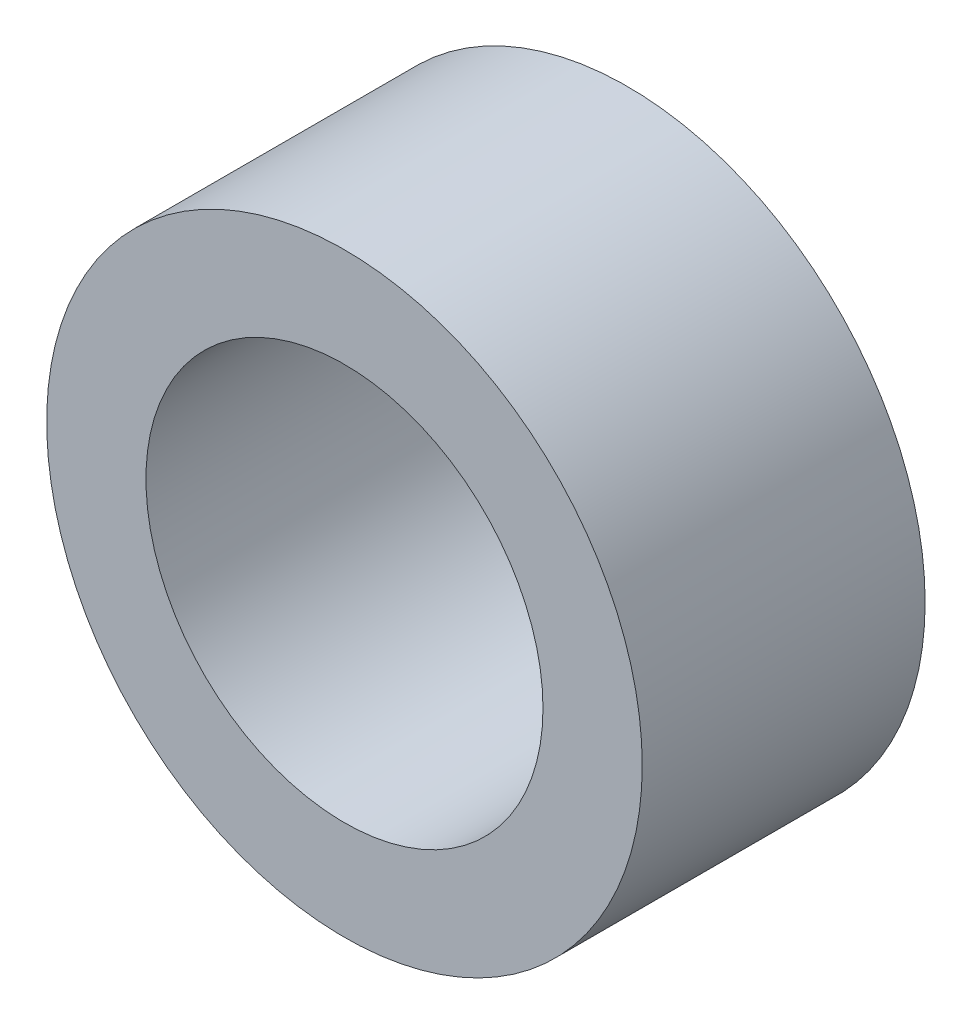
ISO-10303-21;
HEADER;
FILE_DESCRIPTION(('STEP AP214'),'2;1');
FILE_NAME('part.step','',(''),(''),'','','');
FILE_SCHEMA(('AUTOMOTIVE_DESIGN { 1 0 10303 214 1 1 1 1 }'));
ENDSEC;
DATA;
#1=APPLICATION_CONTEXT('core data for automotive mechanical design processes');
#2=APPLICATION_PROTOCOL_DEFINITION('international standard','automotive_design',2000,#1);
#3=PRODUCT_CONTEXT('',#1,'mechanical');
#4=PRODUCT('Part','Part','',(#3));
#5=PRODUCT_RELATED_PRODUCT_CATEGORY('part','',(#4));
#6=PRODUCT_DEFINITION_FORMATION('','',#4);
#7=PRODUCT_DEFINITION_CONTEXT('part definition',#1,'design');
#8=PRODUCT_DEFINITION('design','',#6,#7);
#9=PRODUCT_DEFINITION_SHAPE('','',#8);
#10=(LENGTH_UNIT() NAMED_UNIT(*) SI_UNIT(.MILLI.,.METRE.));
#11=(NAMED_UNIT(*) PLANE_ANGLE_UNIT() SI_UNIT($,.RADIAN.));
#12=(NAMED_UNIT(*) SI_UNIT($,.STERADIAN.) SOLID_ANGLE_UNIT());
#13=UNCERTAINTY_MEASURE_WITH_UNIT(LENGTH_MEASURE(1.E-05),#10,'distance_accuracy_value','');
#14=(GEOMETRIC_REPRESENTATION_CONTEXT(3) GLOBAL_UNCERTAINTY_ASSIGNED_CONTEXT((#13)) GLOBAL_UNIT_ASSIGNED_CONTEXT((#10,
#11,#12)) REPRESENTATION_CONTEXT('',''));
#15=CARTESIAN_POINT('',(0.,0.,0.));
#16=DIRECTION('',(0.,0.,1.));
#17=DIRECTION('',(1.,0.,0.));
#18=AXIS2_PLACEMENT_3D('',#15,#16,#17);
#19=CARTESIAN_POINT('',(0.,0.,0.));
#20=DIRECTION('',(0.,0.,1.));
#21=DIRECTION('',(1.,0.,0.));
#22=AXIS2_PLACEMENT_3D('',#19,#20,#21);
#23=CYLINDRICAL_SURFACE('',#22,2.);
#24=CARTESIAN_POINT('',(0.,0.,0.));
#25=DIRECTION('',(0.,0.,1.));
#26=DIRECTION('',(1.,0.,0.));
#27=AXIS2_PLACEMENT_3D('',#24,#25,#26);
#28=CIRCLE('',#27,2.);
#29=CARTESIAN_POINT('',(2.,0.,0.));
#30=VERTEX_POINT('',#29);
#31=EDGE_CURVE('E18',#30,#30,#28,.F.);
#32=ORIENTED_EDGE('',*,*,#31,.T.);
#33=EDGE_LOOP('',(#32));
#34=FACE_BOUND('',#33,.T.);
#35=CARTESIAN_POINT('',(0.,0.,2.85));
#36=DIRECTION('',(0.,0.,1.));
#37=DIRECTION('',(1.,0.,0.));
#38=AXIS2_PLACEMENT_3D('',#35,#36,#37);
#39=CIRCLE('',#38,2.);
#40=CARTESIAN_POINT('',(2.,0.,2.85));
#41=VERTEX_POINT('',#40);
#42=EDGE_CURVE('E27',#41,#41,#39,.F.);
#43=ORIENTED_EDGE('',*,*,#42,.F.);
#44=EDGE_LOOP('',(#43));
#45=FACE_BOUND('',#44,.T.);
#46=ADVANCED_FACE('F15',(#34,#45),#23,.F.);
#47=CARTESIAN_POINT('',(0.,0.,0.));
#48=DIRECTION('',(0.,0.,1.));
#49=DIRECTION('',(1.,0.,0.));
#50=AXIS2_PLACEMENT_3D('',#47,#48,#49);
#51=PLANE('',#50);
#52=CARTESIAN_POINT('',(0.,0.,0.));
#53=DIRECTION('',(0.,0.,1.));
#54=DIRECTION('',(1.,0.,0.));
#55=AXIS2_PLACEMENT_3D('',#52,#53,#54);
#56=CIRCLE('',#55,3.);
#57=CARTESIAN_POINT('',(3.,0.,0.));
#58=VERTEX_POINT('',#57);
#59=EDGE_CURVE('E22',#58,#58,#56,.T.);
#60=ORIENTED_EDGE('',*,*,#59,.F.);
#61=EDGE_LOOP('',(#60));
#62=FACE_BOUND('',#61,.T.);
#63=ORIENTED_EDGE('',*,*,#31,.F.);
#64=EDGE_LOOP('',(#63));
#65=FACE_BOUND('',#64,.T.);
#66=ADVANCED_FACE('F37',(#62,#65),#51,.F.);
#67=CARTESIAN_POINT('',(0.,0.,2.85));
#68=DIRECTION('',(0.,0.,1.));
#69=DIRECTION('',(1.,0.,0.));
#70=AXIS2_PLACEMENT_3D('',#67,#68,#69);
#71=PLANE('',#70);
#72=CARTESIAN_POINT('',(0.,0.,2.85));
#73=DIRECTION('',(0.,0.,1.));
#74=DIRECTION('',(1.,0.,0.));
#75=AXIS2_PLACEMENT_3D('',#72,#73,#74);
#76=CIRCLE('',#75,3.);
#77=CARTESIAN_POINT('',(3.,0.,2.85));
#78=VERTEX_POINT('',#77);
#79=EDGE_CURVE('E10',#78,#78,#76,.F.);
#80=ORIENTED_EDGE('',*,*,#79,.F.);
#81=EDGE_LOOP('',(#80));
#82=FACE_BOUND('',#81,.T.);
#83=ORIENTED_EDGE('',*,*,#42,.T.);
#84=EDGE_LOOP('',(#83));
#85=FACE_BOUND('',#84,.T.);
#86=ADVANCED_FACE('F39',(#82,#85),#71,.T.);
#87=CARTESIAN_POINT('',(0.,0.,0.));
#88=DIRECTION('',(0.,0.,1.));
#89=DIRECTION('',(1.,0.,0.));
#90=AXIS2_PLACEMENT_3D('',#87,#88,#89);
#91=CYLINDRICAL_SURFACE('',#90,3.);
#92=ORIENTED_EDGE('',*,*,#79,.T.);
#93=EDGE_LOOP('',(#92));
#94=FACE_BOUND('',#93,.T.);
#95=ORIENTED_EDGE('',*,*,#59,.T.);
#96=EDGE_LOOP('',(#95));
#97=FACE_BOUND('',#96,.T.);
#98=ADVANCED_FACE('F46',(#94,#97),#91,.T.);
#99=CLOSED_SHELL('',(#46,#66,#86,#98));
#100=MANIFOLD_SOLID_BREP('B1',#99);
#101=ADVANCED_BREP_SHAPE_REPRESENTATION('',(#18,#100),#14);
#102=SHAPE_DEFINITION_REPRESENTATION(#9,#101);
ENDSEC;
END-ISO-10303-21;
